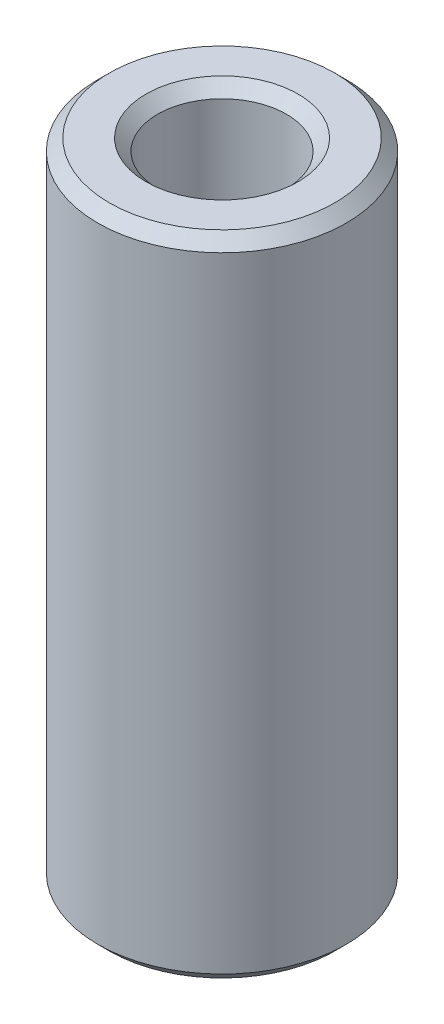
ISO-10303-21;
HEADER;
FILE_DESCRIPTION(('STEP AP214'),'2;1');
FILE_NAME('part.step','',(''),(''),'','','');
FILE_SCHEMA(('AUTOMOTIVE_DESIGN { 1 0 10303 214 1 1 1 1 }'));
ENDSEC;
DATA;
#1=APPLICATION_CONTEXT('core data for automotive mechanical design processes');
#2=APPLICATION_PROTOCOL_DEFINITION('international standard','automotive_design',2000,#1);
#3=PRODUCT_CONTEXT('',#1,'mechanical');
#4=PRODUCT('Part','Part','',(#3));
#5=PRODUCT_RELATED_PRODUCT_CATEGORY('part','',(#4));
#6=PRODUCT_DEFINITION_FORMATION('','',#4);
#7=PRODUCT_DEFINITION_CONTEXT('part definition',#1,'design');
#8=PRODUCT_DEFINITION('design','',#6,#7);
#9=PRODUCT_DEFINITION_SHAPE('','',#8);
#10=(LENGTH_UNIT() NAMED_UNIT(*) SI_UNIT(.MILLI.,.METRE.));
#11=(NAMED_UNIT(*) PLANE_ANGLE_UNIT() SI_UNIT($,.RADIAN.));
#12=(NAMED_UNIT(*) SI_UNIT($,.STERADIAN.) SOLID_ANGLE_UNIT());
#13=UNCERTAINTY_MEASURE_WITH_UNIT(LENGTH_MEASURE(1.E-05),#10,'distance_accuracy_value','');
#14=(GEOMETRIC_REPRESENTATION_CONTEXT(3) GLOBAL_UNCERTAINTY_ASSIGNED_CONTEXT((#13)) GLOBAL_UNIT_ASSIGNED_CONTEXT((#10,
#11,#12)) REPRESENTATION_CONTEXT('',''));
#15=CARTESIAN_POINT('',(0.,0.,0.));
#16=DIRECTION('',(0.,0.,1.));
#17=DIRECTION('',(1.,0.,0.));
#18=AXIS2_PLACEMENT_3D('',#15,#16,#17);
#19=CARTESIAN_POINT('',(0.,221.633096256377,0.));
#20=DIRECTION('',(0.,-1.,0.));
#21=DIRECTION('',(0.,0.,-1.));
#22=AXIS2_PLACEMENT_3D('',#19,#20,#21);
#23=CYLINDRICAL_SURFACE('',#22,42.5);
#24=CARTESIAN_POINT('',(0.,3.9804051533546,0.));
#25=DIRECTION('',(0.,1.,0.));
#26=DIRECTION('',(0.,0.,1.));
#27=AXIS2_PLACEMENT_3D('',#24,#25,#26);
#28=CIRCLE('',#27,42.5);
#29=CARTESIAN_POINT('',(0.,3.9804051533546,42.5));
#30=VERTEX_POINT('',#29);
#31=EDGE_CURVE('E10',#30,#30,#28,.T.);
#32=ORIENTED_EDGE('',*,*,#31,.T.);
#33=EDGE_LOOP('',(#32));
#34=FACE_BOUND('',#33,.T.);
#35=CARTESIAN_POINT('',(0.,217.652691103022,0.));
#36=DIRECTION('',(0.,1.,0.));
#37=DIRECTION('',(0.,0.,1.));
#38=AXIS2_PLACEMENT_3D('',#35,#36,#37);
#39=CIRCLE('',#38,42.5);
#40=CARTESIAN_POINT('',(0.,217.652691103022,42.5));
#41=VERTEX_POINT('',#40);
#42=EDGE_CURVE('E50',#41,#41,#39,.F.);
#43=ORIENTED_EDGE('',*,*,#42,.T.);
#44=EDGE_LOOP('',(#43));
#45=FACE_BOUND('',#44,.T.);
#46=ADVANCED_FACE('F39',(#34,#45),#23,.T.);
#47=CARTESIAN_POINT('',(0.,221.633096256377,0.));
#48=DIRECTION('',(0.,1.,0.));
#49=DIRECTION('',(0.,0.,1.));
#50=AXIS2_PLACEMENT_3D('',#47,#48,#49);
#51=PLANE('',#50);
#52=CARTESIAN_POINT('',(0.,221.633096256377,0.));
#53=DIRECTION('',(0.,1.,0.));
#54=DIRECTION('',(0.,0.,1.));
#55=AXIS2_PLACEMENT_3D('',#52,#53,#54);
#56=CIRCLE('',#55,26.0144837106906);
#57=CARTESIAN_POINT('',(0.,221.633096256377,26.0144837106906));
#58=VERTEX_POINT('',#57);
#59=EDGE_CURVE('E58',#58,#58,#56,.F.);
#60=ORIENTED_EDGE('',*,*,#59,.T.);
#61=EDGE_LOOP('',(#60));
#62=FACE_BOUND('',#61,.T.);
#63=CARTESIAN_POINT('',(0.,221.633096256377,0.));
#64=DIRECTION('',(0.,1.,0.));
#65=DIRECTION('',(0.,0.,1.));
#66=AXIS2_PLACEMENT_3D('',#63,#64,#65);
#67=CIRCLE('',#66,38.5195948466454);
#68=CARTESIAN_POINT('',(0.,221.633096256377,38.5195948466454));
#69=VERTEX_POINT('',#68);
#70=EDGE_CURVE('E61',#69,#69,#67,.T.);
#71=ORIENTED_EDGE('',*,*,#70,.T.);
#72=EDGE_LOOP('',(#71));
#73=FACE_BOUND('',#72,.T.);
#74=ADVANCED_FACE('F88',(#62,#73),#51,.T.);
#75=CARTESIAN_POINT('',(0.,0.,0.));
#76=DIRECTION('',(0.,1.,0.));
#77=DIRECTION('',(0.,0.,1.));
#78=AXIS2_PLACEMENT_3D('',#75,#76,#77);
#79=PLANE('',#78);
#80=CARTESIAN_POINT('',(0.,0.,0.));
#81=DIRECTION('',(0.,1.,0.));
#82=DIRECTION('',(0.,0.,1.));
#83=AXIS2_PLACEMENT_3D('',#80,#81,#82);
#84=CIRCLE('',#83,26.0144837106906);
#85=CARTESIAN_POINT('',(0.,0.,26.0144837106906));
#86=VERTEX_POINT('',#85);
#87=EDGE_CURVE('E51',#86,#86,#84,.T.);
#88=ORIENTED_EDGE('',*,*,#87,.T.);
#89=EDGE_LOOP('',(#88));
#90=FACE_BOUND('',#89,.T.);
#91=CARTESIAN_POINT('',(0.,0.,0.));
#92=DIRECTION('',(0.,1.,0.));
#93=DIRECTION('',(0.,0.,1.));
#94=AXIS2_PLACEMENT_3D('',#91,#92,#93);
#95=CIRCLE('',#94,38.5195948466454);
#96=CARTESIAN_POINT('',(0.,0.,38.5195948466454));
#97=VERTEX_POINT('',#96);
#98=EDGE_CURVE('E54',#97,#97,#95,.F.);
#99=ORIENTED_EDGE('',*,*,#98,.T.);
#100=EDGE_LOOP('',(#99));
#101=FACE_BOUND('',#100,.T.);
#102=ADVANCED_FACE('F83',(#90,#101),#79,.F.);
#103=CARTESIAN_POINT('',(0.,221.633096256377,0.));
#104=DIRECTION('',(0.,-1.,0.));
#105=DIRECTION('',(0.,0.,-1.));
#106=AXIS2_PLACEMENT_3D('',#103,#104,#105);
#107=CYLINDRICAL_SURFACE('',#106,22.034078557336);
#108=CARTESIAN_POINT('',(0.,217.652691103022,0.));
#109=DIRECTION('',(0.,1.,0.));
#110=DIRECTION('',(0.,0.,1.));
#111=AXIS2_PLACEMENT_3D('',#108,#109,#110);
#112=CIRCLE('',#111,22.034078557336);
#113=CARTESIAN_POINT('',(0.,217.652691103022,22.034078557336));
#114=VERTEX_POINT('',#113);
#115=EDGE_CURVE('E67',#114,#114,#112,.T.);
#116=ORIENTED_EDGE('',*,*,#115,.T.);
#117=EDGE_LOOP('',(#116));
#118=FACE_BOUND('',#117,.T.);
#119=CARTESIAN_POINT('',(0.,3.98040515335465,0.));
#120=DIRECTION('',(0.,1.,0.));
#121=DIRECTION('',(0.,0.,1.));
#122=AXIS2_PLACEMENT_3D('',#119,#120,#121);
#123=CIRCLE('',#122,22.034078557336);
#124=CARTESIAN_POINT('',(0.,3.98040515335465,22.034078557336));
#125=VERTEX_POINT('',#124);
#126=EDGE_CURVE('E69',#125,#125,#123,.F.);
#127=ORIENTED_EDGE('',*,*,#126,.T.);
#128=EDGE_LOOP('',(#127));
#129=FACE_BOUND('',#128,.T.);
#130=ADVANCED_FACE('F71',(#118,#129),#107,.F.);
#131=CARTESIAN_POINT('',(0.,217.652691103022,0.));
#132=DIRECTION('',(0.,1.,0.));
#133=DIRECTION('',(0.,0.,1.));
#134=AXIS2_PLACEMENT_3D('',#131,#132,#133);
#135=CONICAL_SURFACE('',#134,22.034078557336,0.785398163397457);
#136=ORIENTED_EDGE('',*,*,#59,.F.);
#137=EDGE_LOOP('',(#136));
#138=FACE_BOUND('',#137,.T.);
#139=ORIENTED_EDGE('',*,*,#115,.F.);
#140=EDGE_LOOP('',(#139));
#141=FACE_BOUND('',#140,.T.);
#142=ADVANCED_FACE('F77',(#138,#141),#135,.F.);
#143=CARTESIAN_POINT('',(0.,0.,0.));
#144=DIRECTION('',(0.,-1.,0.));
#145=DIRECTION('',(0.,0.,-1.));
#146=AXIS2_PLACEMENT_3D('',#143,#144,#145);
#147=CONICAL_SURFACE('',#146,26.0144837106906,0.785398163397447);
#148=ORIENTED_EDGE('',*,*,#126,.F.);
#149=EDGE_LOOP('',(#148));
#150=FACE_BOUND('',#149,.T.);
#151=ORIENTED_EDGE('',*,*,#87,.F.);
#152=EDGE_LOOP('',(#151));
#153=FACE_BOUND('',#152,.T.);
#154=ADVANCED_FACE('F73',(#150,#153),#147,.F.);
#155=CARTESIAN_POINT('',(0.,3.9804051533546,0.));
#156=DIRECTION('',(0.,1.,0.));
#157=DIRECTION('',(0.,0.,1.));
#158=AXIS2_PLACEMENT_3D('',#155,#156,#157);
#159=CONICAL_SURFACE('',#158,42.5,0.785398163397455);
#160=ORIENTED_EDGE('',*,*,#98,.F.);
#161=EDGE_LOOP('',(#160));
#162=FACE_BOUND('',#161,.T.);
#163=ORIENTED_EDGE('',*,*,#31,.F.);
#164=EDGE_LOOP('',(#163));
#165=FACE_BOUND('',#164,.T.);
#166=ADVANCED_FACE('F76',(#162,#165),#159,.T.);
#167=CARTESIAN_POINT('',(0.,221.633096256377,0.));
#168=DIRECTION('',(0.,-1.,0.));
#169=DIRECTION('',(0.,0.,-1.));
#170=AXIS2_PLACEMENT_3D('',#167,#168,#169);
#171=CONICAL_SURFACE('',#170,38.5195948466454,0.785398163397448);
#172=ORIENTED_EDGE('',*,*,#42,.F.);
#173=EDGE_LOOP('',(#172));
#174=FACE_BOUND('',#173,.T.);
#175=ORIENTED_EDGE('',*,*,#70,.F.);
#176=EDGE_LOOP('',(#175));
#177=FACE_BOUND('',#176,.T.);
#178=ADVANCED_FACE('F45',(#174,#177),#171,.T.);
#179=CLOSED_SHELL('',(#46,#74,#102,#130,#142,#154,#166,#178));
#180=MANIFOLD_SOLID_BREP('B2',#179);
#181=ADVANCED_BREP_SHAPE_REPRESENTATION('',(#18,#180),#14);
#182=SHAPE_DEFINITION_REPRESENTATION(#9,#181);
ENDSEC;
END-ISO-10303-21;
